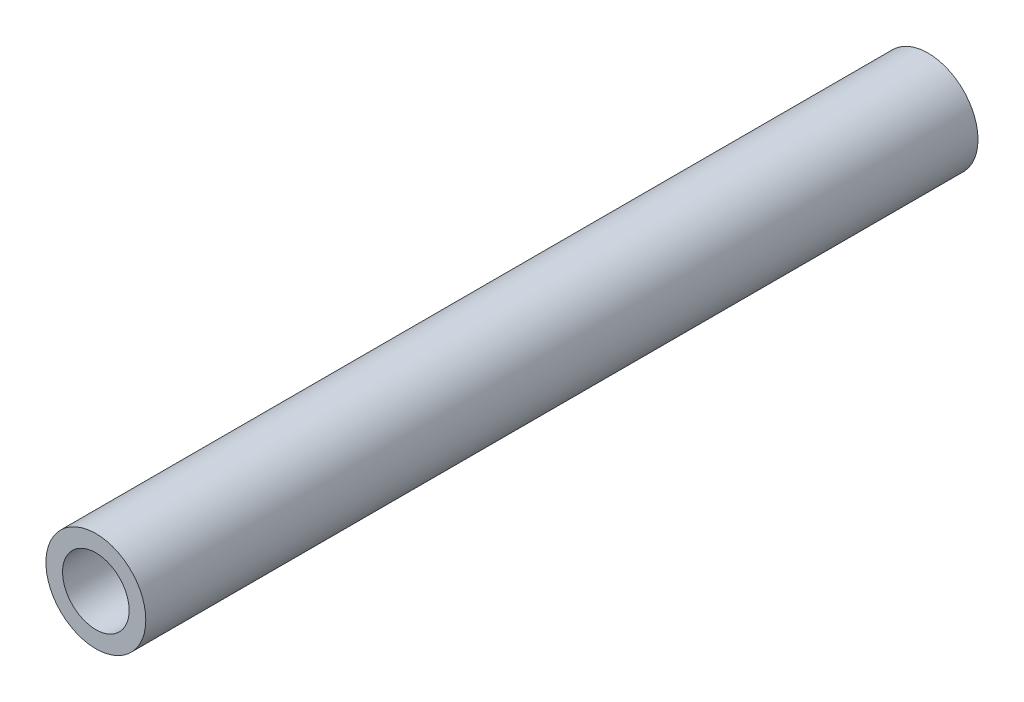
ISO-10303-21;
HEADER;
FILE_DESCRIPTION(('STEP AP214'),'2;1');
FILE_NAME('part.step','',(''),(''),'','','');
FILE_SCHEMA(('AUTOMOTIVE_DESIGN { 1 0 10303 214 1 1 1 1 }'));
ENDSEC;
DATA;
#1=APPLICATION_CONTEXT('core data for automotive mechanical design processes');
#2=APPLICATION_PROTOCOL_DEFINITION('international standard','automotive_design',2000,#1);
#3=PRODUCT_CONTEXT('',#1,'mechanical');
#4=PRODUCT('Part','Part','',(#3));
#5=PRODUCT_RELATED_PRODUCT_CATEGORY('part','',(#4));
#6=PRODUCT_DEFINITION_FORMATION('','',#4);
#7=PRODUCT_DEFINITION_CONTEXT('part definition',#1,'design');
#8=PRODUCT_DEFINITION('design','',#6,#7);
#9=PRODUCT_DEFINITION_SHAPE('','',#8);
#10=(LENGTH_UNIT() NAMED_UNIT(*) SI_UNIT(.MILLI.,.METRE.));
#11=(NAMED_UNIT(*) PLANE_ANGLE_UNIT() SI_UNIT($,.RADIAN.));
#12=(NAMED_UNIT(*) SI_UNIT($,.STERADIAN.) SOLID_ANGLE_UNIT());
#13=UNCERTAINTY_MEASURE_WITH_UNIT(LENGTH_MEASURE(1.E-05),#10,'distance_accuracy_value','');
#14=(GEOMETRIC_REPRESENTATION_CONTEXT(3) GLOBAL_UNCERTAINTY_ASSIGNED_CONTEXT((#13)) GLOBAL_UNIT_ASSIGNED_CONTEXT((#10,
#11,#12)) REPRESENTATION_CONTEXT('',''));
#15=CARTESIAN_POINT('',(0.,0.,0.));
#16=DIRECTION('',(0.,0.,1.));
#17=DIRECTION('',(1.,0.,0.));
#18=AXIS2_PLACEMENT_3D('',#15,#16,#17);
#19=CARTESIAN_POINT('',(0.,0.,50.));
#20=DIRECTION('',(0.,0.,1.));
#21=DIRECTION('',(1.,0.,0.));
#22=AXIS2_PLACEMENT_3D('',#19,#20,#21);
#23=PLANE('',#22);
#24=CARTESIAN_POINT('',(0.,0.,50.));
#25=DIRECTION('',(0.,0.,1.));
#26=DIRECTION('',(1.,0.,0.));
#27=AXIS2_PLACEMENT_3D('',#24,#25,#26);
#28=CIRCLE('',#27,3.);
#29=CARTESIAN_POINT('',(3.,0.,50.));
#30=VERTEX_POINT('',#29);
#31=EDGE_CURVE('E10',#30,#30,#28,.T.);
#32=ORIENTED_EDGE('',*,*,#31,.T.);
#33=EDGE_LOOP('',(#32));
#34=FACE_BOUND('',#33,.T.);
#35=CARTESIAN_POINT('',(0.,0.,50.));
#36=DIRECTION('',(0.,0.,1.));
#37=DIRECTION('',(1.,0.,0.));
#38=AXIS2_PLACEMENT_3D('',#35,#36,#37);
#39=CIRCLE('',#38,2.);
#40=CARTESIAN_POINT('',(2.,0.,50.));
#41=VERTEX_POINT('',#40);
#42=EDGE_CURVE('E54',#41,#41,#39,.T.);
#43=ORIENTED_EDGE('',*,*,#42,.F.);
#44=EDGE_LOOP('',(#43));
#45=FACE_BOUND('',#44,.T.);
#46=ADVANCED_FACE('F41',(#34,#45),#23,.T.);
#47=CARTESIAN_POINT('',(0.,0.,0.));
#48=DIRECTION('',(0.,0.,1.));
#49=DIRECTION('',(1.,0.,0.));
#50=AXIS2_PLACEMENT_3D('',#47,#48,#49);
#51=PLANE('',#50);
#52=CARTESIAN_POINT('',(0.,0.,0.));
#53=DIRECTION('',(0.,0.,1.));
#54=DIRECTION('',(1.,0.,0.));
#55=AXIS2_PLACEMENT_3D('',#52,#53,#54);
#56=CIRCLE('',#55,3.);
#57=CARTESIAN_POINT('',(3.,0.,0.));
#58=VERTEX_POINT('',#57);
#59=EDGE_CURVE('E45',#58,#58,#56,.T.);
#60=ORIENTED_EDGE('',*,*,#59,.F.);
#61=EDGE_LOOP('',(#60));
#62=FACE_BOUND('',#61,.T.);
#63=CARTESIAN_POINT('',(0.,0.,0.));
#64=DIRECTION('',(0.,0.,1.));
#65=DIRECTION('',(1.,0.,0.));
#66=AXIS2_PLACEMENT_3D('',#63,#64,#65);
#67=CIRCLE('',#66,2.);
#68=CARTESIAN_POINT('',(2.,0.,0.));
#69=VERTEX_POINT('',#68);
#70=EDGE_CURVE('E56',#69,#69,#67,.T.);
#71=ORIENTED_EDGE('',*,*,#70,.T.);
#72=EDGE_LOOP('',(#71));
#73=FACE_BOUND('',#72,.T.);
#74=ADVANCED_FACE('F68',(#62,#73),#51,.F.);
#75=CARTESIAN_POINT('',(0.,0.,50.));
#76=DIRECTION('',(0.,0.,-1.));
#77=DIRECTION('',(-1.,0.,0.));
#78=AXIS2_PLACEMENT_3D('',#75,#76,#77);
#79=CYLINDRICAL_SURFACE('',#78,3.);
#80=ORIENTED_EDGE('',*,*,#31,.F.);
#81=EDGE_LOOP('',(#80));
#82=FACE_BOUND('',#81,.T.);
#83=ORIENTED_EDGE('',*,*,#59,.T.);
#84=EDGE_LOOP('',(#83));
#85=FACE_BOUND('',#84,.T.);
#86=ADVANCED_FACE('F43',(#82,#85),#79,.T.);
#87=CARTESIAN_POINT('',(0.,0.,50.));
#88=DIRECTION('',(0.,0.,-1.));
#89=DIRECTION('',(-1.,0.,0.));
#90=AXIS2_PLACEMENT_3D('',#87,#88,#89);
#91=CYLINDRICAL_SURFACE('',#90,2.);
#92=ORIENTED_EDGE('',*,*,#42,.T.);
#93=EDGE_LOOP('',(#92));
#94=FACE_BOUND('',#93,.T.);
#95=ORIENTED_EDGE('',*,*,#70,.F.);
#96=EDGE_LOOP('',(#95));
#97=FACE_BOUND('',#96,.T.);
#98=ADVANCED_FACE('F64',(#94,#97),#91,.F.);
#99=CLOSED_SHELL('',(#46,#74,#86,#98));
#100=MANIFOLD_SOLID_BREP('B2',#99);
#101=ADVANCED_BREP_SHAPE_REPRESENTATION('',(#18,#100),#14);
#102=SHAPE_DEFINITION_REPRESENTATION(#9,#101);
ENDSEC;
END-ISO-10303-21;
